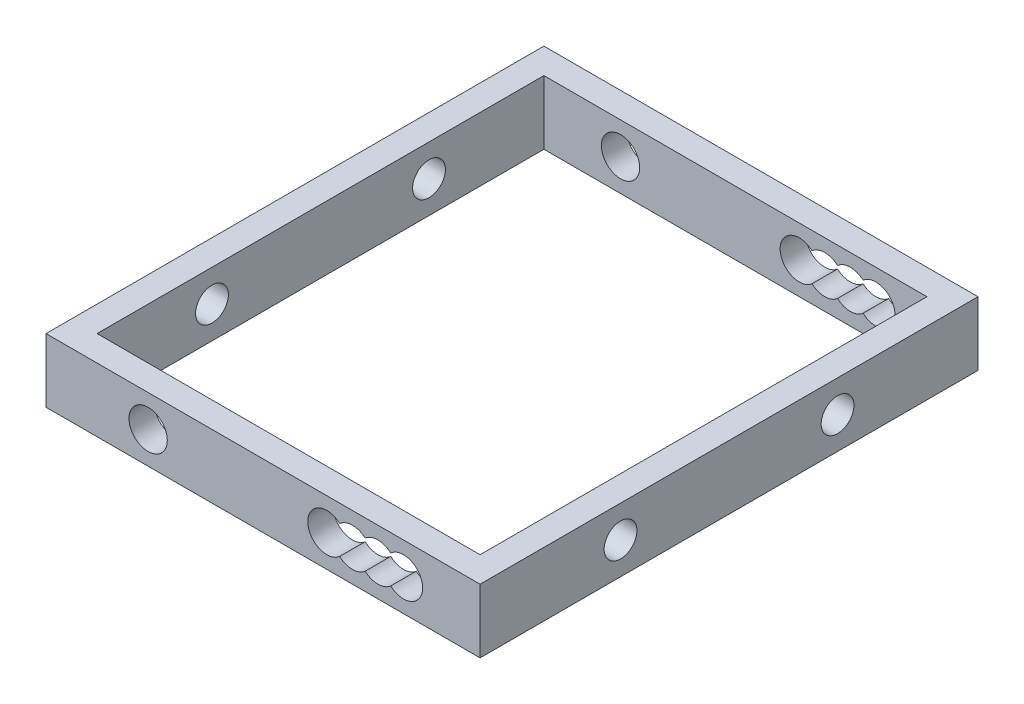
ISO-10303-21;
HEADER;
FILE_DESCRIPTION(('STEP AP214'),'2;1');
FILE_NAME('part.step','',(''),(''),'','','');
FILE_SCHEMA(('AUTOMOTIVE_DESIGN { 1 0 10303 214 1 1 1 1 }'));
ENDSEC;
DATA;
#1=APPLICATION_CONTEXT('core data for automotive mechanical design processes');
#2=APPLICATION_PROTOCOL_DEFINITION('international standard','automotive_design',2000,#1);
#3=PRODUCT_CONTEXT('',#1,'mechanical');
#4=PRODUCT('Part','Part','',(#3));
#5=PRODUCT_RELATED_PRODUCT_CATEGORY('part','',(#4));
#6=PRODUCT_DEFINITION_FORMATION('','',#4);
#7=PRODUCT_DEFINITION_CONTEXT('part definition',#1,'design');
#8=PRODUCT_DEFINITION('design','',#6,#7);
#9=PRODUCT_DEFINITION_SHAPE('','',#8);
#10=(LENGTH_UNIT() NAMED_UNIT(*) SI_UNIT(.MILLI.,.METRE.));
#11=(NAMED_UNIT(*) PLANE_ANGLE_UNIT() SI_UNIT($,.RADIAN.));
#12=(NAMED_UNIT(*) SI_UNIT($,.STERADIAN.) SOLID_ANGLE_UNIT());
#13=UNCERTAINTY_MEASURE_WITH_UNIT(LENGTH_MEASURE(1.E-05),#10,'distance_accuracy_value','');
#14=(GEOMETRIC_REPRESENTATION_CONTEXT(3) GLOBAL_UNCERTAINTY_ASSIGNED_CONTEXT((#13)) GLOBAL_UNIT_ASSIGNED_CONTEXT((#10,
#11,#12)) REPRESENTATION_CONTEXT('',''));
#15=CARTESIAN_POINT('',(0.,0.,0.));
#16=DIRECTION('',(0.,0.,1.));
#17=DIRECTION('',(1.,0.,0.));
#18=AXIS2_PLACEMENT_3D('',#15,#16,#17);
#19=CARTESIAN_POINT('',(15.,-2.5,-37.));
#20=DIRECTION('',(-1.,0.,0.));
#21=DIRECTION('',(0.,0.,1.));
#22=AXIS2_PLACEMENT_3D('',#19,#20,#21);
#23=PLANE('',#22);
#24=CARTESIAN_POINT('',(15.,0.,-26.));
#25=DIRECTION('',(-1.,0.,0.));
#26=DIRECTION('',(0.,0.,1.));
#27=AXIS2_PLACEMENT_3D('',#24,#25,#26);
#28=CIRCLE('',#27,1.28530424586943);
#29=CARTESIAN_POINT('',(15.,0.,-24.7146957541306));
#30=VERTEX_POINT('',#29);
#31=EDGE_CURVE('E285',#30,#30,#28,.T.);
#32=ORIENTED_EDGE('',*,*,#31,.F.);
#33=EDGE_LOOP('',(#32));
#34=FACE_BOUND('',#33,.T.);
#35=CARTESIAN_POINT('',(15.,0.,-9.));
#36=DIRECTION('',(-1.,0.,0.));
#37=DIRECTION('',(0.,0.,1.));
#38=AXIS2_PLACEMENT_3D('',#35,#36,#37);
#39=CIRCLE('',#38,1.28530424586943);
#40=CARTESIAN_POINT('',(15.,0.,-7.71469575413056));
#41=VERTEX_POINT('',#40);
#42=EDGE_CURVE('E282',#41,#41,#39,.T.);
#43=ORIENTED_EDGE('',*,*,#42,.F.);
#44=EDGE_LOOP('',(#43));
#45=FACE_BOUND('',#44,.T.);
#46=DIRECTION('',(0.,0.,1.));
#47=VECTOR('',#46,1.);
#48=CARTESIAN_POINT('',(15.,2.5,-37.));
#49=LINE('',#48,#47);
#50=CARTESIAN_POINT('',(15.,2.5,-35.));
#51=VERTEX_POINT('',#50);
#52=CARTESIAN_POINT('',(15.,2.5,0.));
#53=VERTEX_POINT('',#52);
#54=EDGE_CURVE('E49',#51,#53,#49,.T.);
#55=ORIENTED_EDGE('',*,*,#54,.F.);
#56=DIRECTION('',(0.,1.,0.));
#57=VECTOR('',#56,1.);
#58=CARTESIAN_POINT('',(15.,-2.5,-35.));
#59=LINE('',#58,#57);
#60=CARTESIAN_POINT('',(15.,-2.5,-35.));
#61=VERTEX_POINT('',#60);
#62=EDGE_CURVE('E54',#61,#51,#59,.T.);
#63=ORIENTED_EDGE('',*,*,#62,.F.);
#64=DIRECTION('',(0.,0.,1.));
#65=VECTOR('',#64,1.);
#66=CARTESIAN_POINT('',(15.,-2.5,-37.));
#67=LINE('',#66,#65);
#68=CARTESIAN_POINT('',(15.,-2.5,0.));
#69=VERTEX_POINT('',#68);
#70=EDGE_CURVE('E178',#61,#69,#67,.T.);
#71=ORIENTED_EDGE('',*,*,#70,.T.);
#72=DIRECTION('',(0.,1.,0.));
#73=VECTOR('',#72,1.);
#74=CARTESIAN_POINT('',(15.,-2.5,0.));
#75=LINE('',#74,#73);
#76=EDGE_CURVE('E319',#69,#53,#75,.T.);
#77=ORIENTED_EDGE('',*,*,#76,.T.);
#78=EDGE_LOOP('',(#55,#63,#71,#77));
#79=FACE_BOUND('',#78,.T.);
#80=ADVANCED_FACE('F32',(#34,#45,#79),#23,.T.);
#81=CARTESIAN_POINT('',(0.,0.,2.));
#82=DIRECTION('',(0.,0.,-1.));
#83=DIRECTION('',(-1.,0.,0.));
#84=AXIS2_PLACEMENT_3D('',#81,#82,#83);
#85=PLANE('',#84);
#86=CARTESIAN_POINT('',(-8.99999999999999,0.,2.));
#87=DIRECTION('',(0.,0.,1.));
#88=DIRECTION('',(1.,0.,0.));
#89=AXIS2_PLACEMENT_3D('',#86,#87,#88);
#90=CIRCLE('',#89,1.5);
#91=CARTESIAN_POINT('',(-7.49999999999999,0.,2.));
#92=VERTEX_POINT('',#91);
#93=EDGE_CURVE('E328',#92,#92,#90,.T.);
#94=ORIENTED_EDGE('',*,*,#93,.F.);
#95=EDGE_LOOP('',(#94));
#96=FACE_BOUND('',#95,.T.);
#97=DIRECTION('',(1.,0.,0.));
#98=VECTOR('',#97,1.);
#99=CARTESIAN_POINT('',(-15.,-2.5,2.));
#100=LINE('',#99,#98);
#101=CARTESIAN_POINT('',(-17.,-2.5,2.));
#102=VERTEX_POINT('',#101);
#103=CARTESIAN_POINT('',(17.,-2.5,2.));
#104=VERTEX_POINT('',#103);
#105=EDGE_CURVE('E11',#102,#104,#100,.T.);
#106=ORIENTED_EDGE('',*,*,#105,.T.);
#107=DIRECTION('',(0.,1.,0.));
#108=VECTOR('',#107,1.);
#109=CARTESIAN_POINT('',(17.,-2.5,2.));
#110=LINE('',#109,#108);
#111=CARTESIAN_POINT('',(17.,2.5,2.));
#112=VERTEX_POINT('',#111);
#113=EDGE_CURVE('E262',#104,#112,#110,.T.);
#114=ORIENTED_EDGE('',*,*,#113,.T.);
#115=DIRECTION('',(-1.,0.,0.));
#116=VECTOR('',#115,1.);
#117=CARTESIAN_POINT('',(-15.,2.5,2.));
#118=LINE('',#117,#116);
#119=CARTESIAN_POINT('',(-17.,2.5,2.));
#120=VERTEX_POINT('',#119);
#121=EDGE_CURVE('E41',#112,#120,#118,.T.);
#122=ORIENTED_EDGE('',*,*,#121,.T.);
#123=DIRECTION('',(0.,1.,0.));
#124=VECTOR('',#123,1.);
#125=CARTESIAN_POINT('',(-17.,-2.5,2.));
#126=LINE('',#125,#124);
#127=EDGE_CURVE('E191',#102,#120,#126,.T.);
#128=ORIENTED_EDGE('',*,*,#127,.F.);
#129=EDGE_LOOP('',(#106,#114,#122,#128));
#130=FACE_BOUND('',#129,.T.);
#131=CARTESIAN_POINT('',(7.00000000000001,0.,2.));
#132=DIRECTION('',(0.,0.,1.));
#133=DIRECTION('',(1.,0.,0.));
#134=AXIS2_PLACEMENT_3D('',#131,#132,#133);
#135=CIRCLE('',#134,1.5);
#136=CARTESIAN_POINT('',(6.00000000000001,-1.1180339887499,2.));
#137=VERTEX_POINT('',#136);
#138=CARTESIAN_POINT('',(8.00000000000001,-1.1180339887499,2.));
#139=VERTEX_POINT('',#138);
#140=EDGE_CURVE('E354',#137,#139,#135,.T.);
#141=ORIENTED_EDGE('',*,*,#140,.F.);
#142=CARTESIAN_POINT('',(5.00000000000001,0.,2.));
#143=DIRECTION('',(0.,0.,1.));
#144=DIRECTION('',(1.,0.,0.));
#145=AXIS2_PLACEMENT_3D('',#142,#143,#144);
#146=CIRCLE('',#145,1.5);
#147=CARTESIAN_POINT('',(6.00000000000001,1.1180339887499,2.));
#148=VERTEX_POINT('',#147);
#149=EDGE_CURVE('E350',#148,#137,#146,.T.);
#150=ORIENTED_EDGE('',*,*,#149,.F.);
#151=CARTESIAN_POINT('',(7.00000000000001,0.,2.));
#152=DIRECTION('',(0.,0.,1.));
#153=DIRECTION('',(1.,0.,0.));
#154=AXIS2_PLACEMENT_3D('',#151,#152,#153);
#155=CIRCLE('',#154,1.5);
#156=CARTESIAN_POINT('',(8.00000000000001,1.1180339887499,2.));
#157=VERTEX_POINT('',#156);
#158=EDGE_CURVE('E370',#157,#148,#155,.T.);
#159=ORIENTED_EDGE('',*,*,#158,.F.);
#160=CARTESIAN_POINT('',(9.00000000000001,0.,2.));
#161=DIRECTION('',(0.,0.,1.));
#162=DIRECTION('',(1.,0.,0.));
#163=AXIS2_PLACEMENT_3D('',#160,#161,#162);
#164=CIRCLE('',#163,1.5);
#165=CARTESIAN_POINT('',(10.,1.1180339887499,2.));
#166=VERTEX_POINT('',#165);
#167=EDGE_CURVE('E373',#166,#157,#164,.T.);
#168=ORIENTED_EDGE('',*,*,#167,.F.);
#169=CARTESIAN_POINT('',(11.,0.,2.));
#170=DIRECTION('',(0.,0.,1.));
#171=DIRECTION('',(1.,0.,0.));
#172=AXIS2_PLACEMENT_3D('',#169,#170,#171);
#173=CIRCLE('',#172,1.5);
#174=CARTESIAN_POINT('',(10.,-1.1180339887499,2.));
#175=VERTEX_POINT('',#174);
#176=EDGE_CURVE('E375',#175,#166,#173,.T.);
#177=ORIENTED_EDGE('',*,*,#176,.F.);
#178=CARTESIAN_POINT('',(9.00000000000001,0.,2.));
#179=DIRECTION('',(0.,0.,1.));
#180=DIRECTION('',(1.,0.,0.));
#181=AXIS2_PLACEMENT_3D('',#178,#179,#180);
#182=CIRCLE('',#181,1.5);
#183=EDGE_CURVE('E377',#139,#175,#182,.T.);
#184=ORIENTED_EDGE('',*,*,#183,.F.);
#185=EDGE_LOOP('',(#141,#150,#159,#168,#177,#184));
#186=FACE_BOUND('',#185,.T.);
#187=ADVANCED_FACE('F393',(#96,#130,#186),#85,.F.);
#188=CARTESIAN_POINT('',(0.,0.,0.));
#189=DIRECTION('',(0.,0.,-1.));
#190=DIRECTION('',(-1.,0.,0.));
#191=AXIS2_PLACEMENT_3D('',#188,#189,#190);
#192=PLANE('',#191);
#193=CARTESIAN_POINT('',(-8.99999999999999,0.,0.));
#194=DIRECTION('',(0.,0.,1.));
#195=DIRECTION('',(1.,0.,0.));
#196=AXIS2_PLACEMENT_3D('',#193,#194,#195);
#197=CIRCLE('',#196,1.5);
#198=CARTESIAN_POINT('',(-7.49999999999999,0.,0.));
#199=VERTEX_POINT('',#198);
#200=EDGE_CURVE('E331',#199,#199,#197,.T.);
#201=ORIENTED_EDGE('',*,*,#200,.T.);
#202=EDGE_LOOP('',(#201));
#203=FACE_BOUND('',#202,.T.);
#204=ORIENTED_EDGE('',*,*,#76,.F.);
#205=DIRECTION('',(1.,0.,0.));
#206=VECTOR('',#205,1.);
#207=CARTESIAN_POINT('',(-15.,-2.5,0.));
#208=LINE('',#207,#206);
#209=CARTESIAN_POINT('',(-15.,-2.5,0.));
#210=VERTEX_POINT('',#209);
#211=EDGE_CURVE('E304',#210,#69,#208,.T.);
#212=ORIENTED_EDGE('',*,*,#211,.F.);
#213=DIRECTION('',(0.,-1.,0.));
#214=VECTOR('',#213,1.);
#215=CARTESIAN_POINT('',(-15.,-2.5,0.));
#216=LINE('',#215,#214);
#217=CARTESIAN_POINT('',(-15.,2.5,0.));
#218=VERTEX_POINT('',#217);
#219=EDGE_CURVE('E309',#218,#210,#216,.T.);
#220=ORIENTED_EDGE('',*,*,#219,.F.);
#221=DIRECTION('',(-1.,0.,0.));
#222=VECTOR('',#221,1.);
#223=CARTESIAN_POINT('',(-15.,2.5,0.));
#224=LINE('',#223,#222);
#225=EDGE_CURVE('E315',#53,#218,#224,.T.);
#226=ORIENTED_EDGE('',*,*,#225,.F.);
#227=EDGE_LOOP('',(#204,#212,#220,#226));
#228=FACE_BOUND('',#227,.T.);
#229=CARTESIAN_POINT('',(5.00000000000001,0.,0.));
#230=DIRECTION('',(0.,0.,1.));
#231=DIRECTION('',(1.,0.,0.));
#232=AXIS2_PLACEMENT_3D('',#229,#230,#231);
#233=CIRCLE('',#232,1.5);
#234=CARTESIAN_POINT('',(6.00000000000001,1.1180339887499,0.));
#235=VERTEX_POINT('',#234);
#236=CARTESIAN_POINT('',(6.00000000000001,-1.1180339887499,0.));
#237=VERTEX_POINT('',#236);
#238=EDGE_CURVE('E351',#235,#237,#233,.T.);
#239=ORIENTED_EDGE('',*,*,#238,.T.);
#240=CARTESIAN_POINT('',(7.00000000000001,0.,0.));
#241=DIRECTION('',(0.,0.,1.));
#242=DIRECTION('',(1.,0.,0.));
#243=AXIS2_PLACEMENT_3D('',#240,#241,#242);
#244=CIRCLE('',#243,1.5);
#245=CARTESIAN_POINT('',(8.00000000000001,-1.1180339887499,0.));
#246=VERTEX_POINT('',#245);
#247=EDGE_CURVE('E272',#237,#246,#244,.T.);
#248=ORIENTED_EDGE('',*,*,#247,.T.);
#249=CARTESIAN_POINT('',(9.00000000000001,0.,0.));
#250=DIRECTION('',(0.,0.,1.));
#251=DIRECTION('',(1.,0.,0.));
#252=AXIS2_PLACEMENT_3D('',#249,#250,#251);
#253=CIRCLE('',#252,1.5);
#254=CARTESIAN_POINT('',(10.,-1.1180339887499,0.));
#255=VERTEX_POINT('',#254);
#256=EDGE_CURVE('E364',#246,#255,#253,.T.);
#257=ORIENTED_EDGE('',*,*,#256,.T.);
#258=CARTESIAN_POINT('',(11.,0.,0.));
#259=DIRECTION('',(0.,0.,1.));
#260=DIRECTION('',(1.,0.,0.));
#261=AXIS2_PLACEMENT_3D('',#258,#259,#260);
#262=CIRCLE('',#261,1.5);
#263=CARTESIAN_POINT('',(10.,1.1180339887499,0.));
#264=VERTEX_POINT('',#263);
#265=EDGE_CURVE('E361',#255,#264,#262,.T.);
#266=ORIENTED_EDGE('',*,*,#265,.T.);
#267=CARTESIAN_POINT('',(9.00000000000001,0.,0.));
#268=DIRECTION('',(0.,0.,1.));
#269=DIRECTION('',(1.,0.,0.));
#270=AXIS2_PLACEMENT_3D('',#267,#268,#269);
#271=CIRCLE('',#270,1.5);
#272=CARTESIAN_POINT('',(8.00000000000001,1.1180339887499,0.));
#273=VERTEX_POINT('',#272);
#274=EDGE_CURVE('E358',#264,#273,#271,.T.);
#275=ORIENTED_EDGE('',*,*,#274,.T.);
#276=CARTESIAN_POINT('',(7.00000000000001,0.,0.));
#277=DIRECTION('',(0.,0.,1.));
#278=DIRECTION('',(1.,0.,0.));
#279=AXIS2_PLACEMENT_3D('',#276,#277,#278);
#280=CIRCLE('',#279,1.5);
#281=EDGE_CURVE('E355',#273,#235,#280,.T.);
#282=ORIENTED_EDGE('',*,*,#281,.T.);
#283=EDGE_LOOP('',(#239,#248,#257,#266,#275,#282));
#284=FACE_BOUND('',#283,.T.);
#285=ADVANCED_FACE('F317',(#203,#228,#284),#192,.T.);
#286=CARTESIAN_POINT('',(-15.,2.5,2.));
#287=DIRECTION('',(0.,-1.,0.));
#288=DIRECTION('',(0.,0.,-1.));
#289=AXIS2_PLACEMENT_3D('',#286,#287,#288);
#290=PLANE('',#289);
#291=ORIENTED_EDGE('',*,*,#225,.T.);
#292=DIRECTION('',(0.,0.,1.));
#293=VECTOR('',#292,1.);
#294=CARTESIAN_POINT('',(-15.,2.5,-37.));
#295=LINE('',#294,#293);
#296=CARTESIAN_POINT('',(-15.,2.5,-35.));
#297=VERTEX_POINT('',#296);
#298=EDGE_CURVE('E190',#297,#218,#295,.T.);
#299=ORIENTED_EDGE('',*,*,#298,.F.);
#300=DIRECTION('',(-1.,0.,0.));
#301=VECTOR('',#300,1.);
#302=CARTESIAN_POINT('',(-15.,2.5,-35.));
#303=LINE('',#302,#301);
#304=EDGE_CURVE('E255',#51,#297,#303,.T.);
#305=ORIENTED_EDGE('',*,*,#304,.F.);
#306=ORIENTED_EDGE('',*,*,#54,.T.);
#307=EDGE_LOOP('',(#291,#299,#305,#306));
#308=FACE_BOUND('',#307,.T.);
#309=DIRECTION('',(0.,0.,1.));
#310=VECTOR('',#309,1.);
#311=CARTESIAN_POINT('',(-17.,2.5,-37.));
#312=LINE('',#311,#310);
#313=CARTESIAN_POINT('',(-17.,2.5,-37.));
#314=VERTEX_POINT('',#313);
#315=EDGE_CURVE('E172',#314,#120,#312,.T.);
#316=ORIENTED_EDGE('',*,*,#315,.T.);
#317=ORIENTED_EDGE('',*,*,#121,.F.);
#318=DIRECTION('',(0.,0.,1.));
#319=VECTOR('',#318,1.);
#320=CARTESIAN_POINT('',(17.,2.5,-37.));
#321=LINE('',#320,#319);
#322=CARTESIAN_POINT('',(17.,2.5,-37.));
#323=VERTEX_POINT('',#322);
#324=EDGE_CURVE('E174',#323,#112,#321,.T.);
#325=ORIENTED_EDGE('',*,*,#324,.F.);
#326=DIRECTION('',(-1.,0.,0.));
#327=VECTOR('',#326,1.);
#328=CARTESIAN_POINT('',(15.,2.5,-37.));
#329=LINE('',#328,#327);
#330=EDGE_CURVE('E169',#323,#314,#329,.T.);
#331=ORIENTED_EDGE('',*,*,#330,.T.);
#332=EDGE_LOOP('',(#316,#317,#325,#331));
#333=FACE_BOUND('',#332,.T.);
#334=ADVANCED_FACE('F34',(#308,#333),#290,.F.);
#335=CARTESIAN_POINT('',(-15.,-2.5,2.));
#336=DIRECTION('',(0.,1.,0.));
#337=DIRECTION('',(0.,0.,1.));
#338=AXIS2_PLACEMENT_3D('',#335,#336,#337);
#339=PLANE('',#338);
#340=DIRECTION('',(0.,0.,1.));
#341=VECTOR('',#340,1.);
#342=CARTESIAN_POINT('',(-15.,-2.5,-37.));
#343=LINE('',#342,#341);
#344=CARTESIAN_POINT('',(-15.,-2.5,-35.));
#345=VERTEX_POINT('',#344);
#346=EDGE_CURVE('E198',#345,#210,#343,.T.);
#347=ORIENTED_EDGE('',*,*,#346,.T.);
#348=ORIENTED_EDGE('',*,*,#211,.T.);
#349=ORIENTED_EDGE('',*,*,#70,.F.);
#350=DIRECTION('',(1.,0.,0.));
#351=VECTOR('',#350,1.);
#352=CARTESIAN_POINT('',(-15.,-2.5,-35.));
#353=LINE('',#352,#351);
#354=EDGE_CURVE('E259',#345,#61,#353,.T.);
#355=ORIENTED_EDGE('',*,*,#354,.F.);
#356=EDGE_LOOP('',(#347,#348,#349,#355));
#357=FACE_BOUND('',#356,.T.);
#358=ORIENTED_EDGE('',*,*,#105,.F.);
#359=DIRECTION('',(0.,0.,1.));
#360=VECTOR('',#359,1.);
#361=CARTESIAN_POINT('',(-17.,-2.5,-37.));
#362=LINE('',#361,#360);
#363=CARTESIAN_POINT('',(-17.,-2.5,-37.));
#364=VERTEX_POINT('',#363);
#365=EDGE_CURVE('E196',#364,#102,#362,.T.);
#366=ORIENTED_EDGE('',*,*,#365,.F.);
#367=DIRECTION('',(1.,0.,0.));
#368=VECTOR('',#367,1.);
#369=CARTESIAN_POINT('',(15.,-2.5,-37.));
#370=LINE('',#369,#368);
#371=CARTESIAN_POINT('',(17.,-2.5,-37.));
#372=VERTEX_POINT('',#371);
#373=EDGE_CURVE('E186',#364,#372,#370,.T.);
#374=ORIENTED_EDGE('',*,*,#373,.T.);
#375=DIRECTION('',(0.,0.,1.));
#376=VECTOR('',#375,1.);
#377=CARTESIAN_POINT('',(17.,-2.5,-37.));
#378=LINE('',#377,#376);
#379=EDGE_CURVE('E380',#372,#104,#378,.T.);
#380=ORIENTED_EDGE('',*,*,#379,.T.);
#381=EDGE_LOOP('',(#358,#366,#374,#380));
#382=FACE_BOUND('',#381,.T.);
#383=ADVANCED_FACE('F301',(#357,#382),#339,.F.);
#384=CARTESIAN_POINT('',(-8.99999999999999,0.,2.));
#385=DIRECTION('',(0.,0.,-1.));
#386=DIRECTION('',(-1.,0.,0.));
#387=AXIS2_PLACEMENT_3D('',#384,#385,#386);
#388=CYLINDRICAL_SURFACE('',#387,1.5);
#389=ORIENTED_EDGE('',*,*,#93,.T.);
#390=EDGE_LOOP('',(#389));
#391=FACE_BOUND('',#390,.T.);
#392=ORIENTED_EDGE('',*,*,#200,.F.);
#393=EDGE_LOOP('',(#392));
#394=FACE_BOUND('',#393,.T.);
#395=ADVANCED_FACE('F392',(#391,#394),#388,.F.);
#396=CARTESIAN_POINT('',(7.00000000000001,0.,2.));
#397=DIRECTION('',(0.,0.,-1.));
#398=DIRECTION('',(-1.,0.,0.));
#399=AXIS2_PLACEMENT_3D('',#396,#397,#398);
#400=CYLINDRICAL_SURFACE('',#399,1.5);
#401=ORIENTED_EDGE('',*,*,#247,.F.);
#402=DIRECTION('',(0.,0.,-1.));
#403=VECTOR('',#402,1.);
#404=CARTESIAN_POINT('',(6.00000000000001,-1.1180339887499,2.));
#405=LINE('',#404,#403);
#406=EDGE_CURVE('E347',#137,#237,#405,.T.);
#407=ORIENTED_EDGE('',*,*,#406,.F.);
#408=ORIENTED_EDGE('',*,*,#140,.T.);
#409=DIRECTION('',(0.,0.,-1.));
#410=VECTOR('',#409,1.);
#411=CARTESIAN_POINT('',(8.00000000000001,-1.1180339887499,2.));
#412=LINE('',#411,#410);
#413=EDGE_CURVE('E334',#139,#246,#412,.T.);
#414=ORIENTED_EDGE('',*,*,#413,.T.);
#415=EDGE_LOOP('',(#401,#407,#408,#414));
#416=FACE_BOUND('',#415,.T.);
#417=ADVANCED_FACE('F429',(#416),#400,.F.);
#418=CARTESIAN_POINT('',(9.00000000000001,0.,2.));
#419=DIRECTION('',(0.,0.,-1.));
#420=DIRECTION('',(-1.,0.,0.));
#421=AXIS2_PLACEMENT_3D('',#418,#419,#420);
#422=CYLINDRICAL_SURFACE('',#421,1.5);
#423=ORIENTED_EDGE('',*,*,#256,.F.);
#424=ORIENTED_EDGE('',*,*,#413,.F.);
#425=ORIENTED_EDGE('',*,*,#183,.T.);
#426=DIRECTION('',(0.,0.,-1.));
#427=VECTOR('',#426,1.);
#428=CARTESIAN_POINT('',(10.,-1.1180339887499,2.));
#429=LINE('',#428,#427);
#430=EDGE_CURVE('E339',#175,#255,#429,.T.);
#431=ORIENTED_EDGE('',*,*,#430,.T.);
#432=EDGE_LOOP('',(#423,#424,#425,#431));
#433=FACE_BOUND('',#432,.T.);
#434=ADVANCED_FACE('F425',(#433),#422,.F.);
#435=CARTESIAN_POINT('',(11.,0.,2.));
#436=DIRECTION('',(0.,0.,-1.));
#437=DIRECTION('',(-1.,0.,0.));
#438=AXIS2_PLACEMENT_3D('',#435,#436,#437);
#439=CYLINDRICAL_SURFACE('',#438,1.5);
#440=ORIENTED_EDGE('',*,*,#265,.F.);
#441=ORIENTED_EDGE('',*,*,#430,.F.);
#442=ORIENTED_EDGE('',*,*,#176,.T.);
#443=DIRECTION('',(0.,0.,-1.));
#444=VECTOR('',#443,1.);
#445=CARTESIAN_POINT('',(10.,1.1180339887499,2.));
#446=LINE('',#445,#444);
#447=EDGE_CURVE('E341',#166,#264,#446,.T.);
#448=ORIENTED_EDGE('',*,*,#447,.T.);
#449=EDGE_LOOP('',(#440,#441,#442,#448));
#450=FACE_BOUND('',#449,.T.);
#451=ADVANCED_FACE('F421',(#450),#439,.F.);
#452=CARTESIAN_POINT('',(9.00000000000001,0.,2.));
#453=DIRECTION('',(0.,0.,-1.));
#454=DIRECTION('',(-1.,0.,0.));
#455=AXIS2_PLACEMENT_3D('',#452,#453,#454);
#456=CYLINDRICAL_SURFACE('',#455,1.5);
#457=ORIENTED_EDGE('',*,*,#274,.F.);
#458=ORIENTED_EDGE('',*,*,#447,.F.);
#459=ORIENTED_EDGE('',*,*,#167,.T.);
#460=DIRECTION('',(0.,0.,-1.));
#461=VECTOR('',#460,1.);
#462=CARTESIAN_POINT('',(8.00000000000001,1.1180339887499,2.));
#463=LINE('',#462,#461);
#464=EDGE_CURVE('E343',#157,#273,#463,.T.);
#465=ORIENTED_EDGE('',*,*,#464,.T.);
#466=EDGE_LOOP('',(#457,#458,#459,#465));
#467=FACE_BOUND('',#466,.T.);
#468=ADVANCED_FACE('F417',(#467),#456,.F.);
#469=CARTESIAN_POINT('',(7.00000000000001,0.,2.));
#470=DIRECTION('',(0.,0.,-1.));
#471=DIRECTION('',(-1.,0.,0.));
#472=AXIS2_PLACEMENT_3D('',#469,#470,#471);
#473=CYLINDRICAL_SURFACE('',#472,1.5);
#474=ORIENTED_EDGE('',*,*,#281,.F.);
#475=ORIENTED_EDGE('',*,*,#464,.F.);
#476=ORIENTED_EDGE('',*,*,#158,.T.);
#477=DIRECTION('',(0.,0.,-1.));
#478=VECTOR('',#477,1.);
#479=CARTESIAN_POINT('',(6.00000000000001,1.1180339887499,2.));
#480=LINE('',#479,#478);
#481=EDGE_CURVE('E345',#148,#235,#480,.T.);
#482=ORIENTED_EDGE('',*,*,#481,.T.);
#483=EDGE_LOOP('',(#474,#475,#476,#482));
#484=FACE_BOUND('',#483,.T.);
#485=ADVANCED_FACE('F413',(#484),#473,.F.);
#486=CARTESIAN_POINT('',(5.00000000000001,0.,2.));
#487=DIRECTION('',(0.,0.,-1.));
#488=DIRECTION('',(-1.,0.,0.));
#489=AXIS2_PLACEMENT_3D('',#486,#487,#488);
#490=CYLINDRICAL_SURFACE('',#489,1.5);
#491=ORIENTED_EDGE('',*,*,#238,.F.);
#492=ORIENTED_EDGE('',*,*,#481,.F.);
#493=ORIENTED_EDGE('',*,*,#149,.T.);
#494=ORIENTED_EDGE('',*,*,#406,.T.);
#495=EDGE_LOOP('',(#491,#492,#493,#494));
#496=FACE_BOUND('',#495,.T.);
#497=ADVANCED_FACE('F410',(#496),#490,.F.);
#498=CARTESIAN_POINT('',(17.,-2.5,-37.));
#499=DIRECTION('',(1.,0.,0.));
#500=DIRECTION('',(0.,0.,-1.));
#501=AXIS2_PLACEMENT_3D('',#498,#499,#500);
#502=PLANE('',#501);
#503=CARTESIAN_POINT('',(17.,0.,-26.));
#504=DIRECTION('',(1.,0.,0.));
#505=DIRECTION('',(0.,0.,-1.));
#506=AXIS2_PLACEMENT_3D('',#503,#504,#505);
#507=CIRCLE('',#506,1.28530424586943);
#508=CARTESIAN_POINT('',(17.,0.,-27.2853042458694));
#509=VERTEX_POINT('',#508);
#510=EDGE_CURVE('E467',#509,#509,#507,.T.);
#511=ORIENTED_EDGE('',*,*,#510,.F.);
#512=EDGE_LOOP('',(#511));
#513=FACE_BOUND('',#512,.T.);
#514=CARTESIAN_POINT('',(17.,0.,-9.));
#515=DIRECTION('',(1.,0.,0.));
#516=DIRECTION('',(0.,0.,-1.));
#517=AXIS2_PLACEMENT_3D('',#514,#515,#516);
#518=CIRCLE('',#517,1.28530424586943);
#519=CARTESIAN_POINT('',(17.,0.,-10.2853042458694));
#520=VERTEX_POINT('',#519);
#521=EDGE_CURVE('E278',#520,#520,#518,.T.);
#522=ORIENTED_EDGE('',*,*,#521,.F.);
#523=EDGE_LOOP('',(#522));
#524=FACE_BOUND('',#523,.T.);
#525=ORIENTED_EDGE('',*,*,#113,.F.);
#526=ORIENTED_EDGE('',*,*,#379,.F.);
#527=DIRECTION('',(0.,1.,0.));
#528=VECTOR('',#527,1.);
#529=CARTESIAN_POINT('',(17.,-2.5,-37.));
#530=LINE('',#529,#528);
#531=EDGE_CURVE('E179',#372,#323,#530,.T.);
#532=ORIENTED_EDGE('',*,*,#531,.T.);
#533=ORIENTED_EDGE('',*,*,#324,.T.);
#534=EDGE_LOOP('',(#525,#526,#532,#533));
#535=FACE_BOUND('',#534,.T.);
#536=ADVANCED_FACE('F408',(#513,#524,#535),#502,.T.);
#537=CARTESIAN_POINT('',(0.,0.,-37.));
#538=DIRECTION('',(0.,0.,-1.));
#539=DIRECTION('',(-1.,0.,0.));
#540=AXIS2_PLACEMENT_3D('',#537,#538,#539);
#541=PLANE('',#540);
#542=ORIENTED_EDGE('',*,*,#373,.F.);
#543=DIRECTION('',(0.,1.,0.));
#544=VECTOR('',#543,1.);
#545=CARTESIAN_POINT('',(-17.,-2.5,-37.));
#546=LINE('',#545,#544);
#547=EDGE_CURVE('E182',#364,#314,#546,.T.);
#548=ORIENTED_EDGE('',*,*,#547,.T.);
#549=ORIENTED_EDGE('',*,*,#330,.F.);
#550=ORIENTED_EDGE('',*,*,#531,.F.);
#551=EDGE_LOOP('',(#542,#548,#549,#550));
#552=FACE_BOUND('',#551,.T.);
#553=CARTESIAN_POINT('',(-8.99999999999999,0.,-37.));
#554=DIRECTION('',(0.,0.,1.));
#555=DIRECTION('',(1.,0.,0.));
#556=AXIS2_PLACEMENT_3D('',#553,#554,#555);
#557=CIRCLE('',#556,1.5);
#558=CARTESIAN_POINT('',(-7.49999999999999,0.,-37.));
#559=VERTEX_POINT('',#558);
#560=EDGE_CURVE('E248',#559,#559,#557,.T.);
#561=ORIENTED_EDGE('',*,*,#560,.T.);
#562=EDGE_LOOP('',(#561));
#563=FACE_BOUND('',#562,.T.);
#564=CARTESIAN_POINT('',(5.00000000000001,0.,-37.));
#565=DIRECTION('',(0.,0.,1.));
#566=DIRECTION('',(1.,0.,0.));
#567=AXIS2_PLACEMENT_3D('',#564,#565,#566);
#568=CIRCLE('',#567,1.5);
#569=CARTESIAN_POINT('',(6.00000000000001,1.1180339887499,-37.));
#570=VERTEX_POINT('',#569);
#571=CARTESIAN_POINT('',(6.00000000000001,-1.1180339887499,-37.));
#572=VERTEX_POINT('',#571);
#573=EDGE_CURVE('E206',#570,#572,#568,.T.);
#574=ORIENTED_EDGE('',*,*,#573,.T.);
#575=CARTESIAN_POINT('',(7.00000000000001,0.,-37.));
#576=DIRECTION('',(0.,0.,1.));
#577=DIRECTION('',(1.,0.,0.));
#578=AXIS2_PLACEMENT_3D('',#575,#576,#577);
#579=CIRCLE('',#578,1.5);
#580=CARTESIAN_POINT('',(8.00000000000001,-1.1180339887499,-37.));
#581=VERTEX_POINT('',#580);
#582=EDGE_CURVE('E218',#572,#581,#579,.T.);
#583=ORIENTED_EDGE('',*,*,#582,.T.);
#584=CARTESIAN_POINT('',(9.00000000000001,0.,-37.));
#585=DIRECTION('',(0.,0.,1.));
#586=DIRECTION('',(1.,0.,0.));
#587=AXIS2_PLACEMENT_3D('',#584,#585,#586);
#588=CIRCLE('',#587,1.5);
#589=CARTESIAN_POINT('',(10.,-1.1180339887499,-37.));
#590=VERTEX_POINT('',#589);
#591=EDGE_CURVE('E221',#581,#590,#588,.T.);
#592=ORIENTED_EDGE('',*,*,#591,.T.);
#593=CARTESIAN_POINT('',(11.,0.,-37.));
#594=DIRECTION('',(0.,0.,1.));
#595=DIRECTION('',(1.,0.,0.));
#596=AXIS2_PLACEMENT_3D('',#593,#594,#595);
#597=CIRCLE('',#596,1.5);
#598=CARTESIAN_POINT('',(10.,1.1180339887499,-37.));
#599=VERTEX_POINT('',#598);
#600=EDGE_CURVE('E224',#590,#599,#597,.T.);
#601=ORIENTED_EDGE('',*,*,#600,.T.);
#602=CARTESIAN_POINT('',(9.00000000000001,0.,-37.));
#603=DIRECTION('',(0.,0.,1.));
#604=DIRECTION('',(1.,0.,0.));
#605=AXIS2_PLACEMENT_3D('',#602,#603,#604);
#606=CIRCLE('',#605,1.5);
#607=CARTESIAN_POINT('',(8.00000000000001,1.1180339887499,-37.));
#608=VERTEX_POINT('',#607);
#609=EDGE_CURVE('E227',#599,#608,#606,.T.);
#610=ORIENTED_EDGE('',*,*,#609,.T.);
#611=CARTESIAN_POINT('',(7.00000000000001,0.,-37.));
#612=DIRECTION('',(0.,0.,1.));
#613=DIRECTION('',(1.,0.,0.));
#614=AXIS2_PLACEMENT_3D('',#611,#612,#613);
#615=CIRCLE('',#614,1.5);
#616=EDGE_CURVE('E230',#608,#570,#615,.T.);
#617=ORIENTED_EDGE('',*,*,#616,.T.);
#618=EDGE_LOOP('',(#574,#583,#592,#601,#610,#617));
#619=FACE_BOUND('',#618,.T.);
#620=ADVANCED_FACE('F183',(#552,#563,#619),#541,.T.);
#621=CARTESIAN_POINT('',(0.,0.,-35.));
#622=DIRECTION('',(0.,0.,-1.));
#623=DIRECTION('',(-1.,0.,0.));
#624=AXIS2_PLACEMENT_3D('',#621,#622,#623);
#625=PLANE('',#624);
#626=CARTESIAN_POINT('',(-8.99999999999999,0.,-35.));
#627=DIRECTION('',(0.,0.,1.));
#628=DIRECTION('',(1.,0.,0.));
#629=AXIS2_PLACEMENT_3D('',#626,#627,#628);
#630=CIRCLE('',#629,1.5);
#631=CARTESIAN_POINT('',(-7.49999999999999,0.,-35.));
#632=VERTEX_POINT('',#631);
#633=EDGE_CURVE('E249',#632,#632,#630,.T.);
#634=ORIENTED_EDGE('',*,*,#633,.F.);
#635=EDGE_LOOP('',(#634));
#636=FACE_BOUND('',#635,.T.);
#637=ORIENTED_EDGE('',*,*,#62,.T.);
#638=ORIENTED_EDGE('',*,*,#304,.T.);
#639=DIRECTION('',(0.,-1.,0.));
#640=VECTOR('',#639,1.);
#641=CARTESIAN_POINT('',(-15.,-2.5,-35.));
#642=LINE('',#641,#640);
#643=EDGE_CURVE('E257',#297,#345,#642,.T.);
#644=ORIENTED_EDGE('',*,*,#643,.T.);
#645=ORIENTED_EDGE('',*,*,#354,.T.);
#646=EDGE_LOOP('',(#637,#638,#644,#645));
#647=FACE_BOUND('',#646,.T.);
#648=CARTESIAN_POINT('',(7.00000000000001,0.,-35.));
#649=DIRECTION('',(0.,0.,1.));
#650=DIRECTION('',(1.,0.,0.));
#651=AXIS2_PLACEMENT_3D('',#648,#649,#650);
#652=CIRCLE('',#651,1.5);
#653=CARTESIAN_POINT('',(6.00000000000001,-1.1180339887499,-35.));
#654=VERTEX_POINT('',#653);
#655=CARTESIAN_POINT('',(8.00000000000001,-1.1180339887499,-35.));
#656=VERTEX_POINT('',#655);
#657=EDGE_CURVE('E203',#654,#656,#652,.T.);
#658=ORIENTED_EDGE('',*,*,#657,.F.);
#659=CARTESIAN_POINT('',(5.00000000000001,0.,-35.));
#660=DIRECTION('',(0.,0.,1.));
#661=DIRECTION('',(1.,0.,0.));
#662=AXIS2_PLACEMENT_3D('',#659,#660,#661);
#663=CIRCLE('',#662,1.5);
#664=CARTESIAN_POINT('',(6.00000000000001,1.1180339887499,-35.));
#665=VERTEX_POINT('',#664);
#666=EDGE_CURVE('E215',#665,#654,#663,.T.);
#667=ORIENTED_EDGE('',*,*,#666,.F.);
#668=CARTESIAN_POINT('',(7.00000000000001,0.,-35.));
#669=DIRECTION('',(0.,0.,1.));
#670=DIRECTION('',(1.,0.,0.));
#671=AXIS2_PLACEMENT_3D('',#668,#669,#670);
#672=CIRCLE('',#671,1.5);
#673=CARTESIAN_POINT('',(8.00000000000001,1.1180339887499,-35.));
#674=VERTEX_POINT('',#673);
#675=EDGE_CURVE('E212',#674,#665,#672,.T.);
#676=ORIENTED_EDGE('',*,*,#675,.F.);
#677=CARTESIAN_POINT('',(9.00000000000001,0.,-35.));
#678=DIRECTION('',(0.,0.,1.));
#679=DIRECTION('',(1.,0.,0.));
#680=AXIS2_PLACEMENT_3D('',#677,#678,#679);
#681=CIRCLE('',#680,1.5);
#682=CARTESIAN_POINT('',(10.,1.1180339887499,-35.));
#683=VERTEX_POINT('',#682);
#684=EDGE_CURVE('E210',#683,#674,#681,.T.);
#685=ORIENTED_EDGE('',*,*,#684,.F.);
#686=CARTESIAN_POINT('',(11.,0.,-35.));
#687=DIRECTION('',(0.,0.,1.));
#688=DIRECTION('',(1.,0.,0.));
#689=AXIS2_PLACEMENT_3D('',#686,#687,#688);
#690=CIRCLE('',#689,1.5);
#691=CARTESIAN_POINT('',(10.,-1.1180339887499,-35.));
#692=VERTEX_POINT('',#691);
#693=EDGE_CURVE('E208',#692,#683,#690,.T.);
#694=ORIENTED_EDGE('',*,*,#693,.F.);
#695=CARTESIAN_POINT('',(9.00000000000001,0.,-35.));
#696=DIRECTION('',(0.,0.,1.));
#697=DIRECTION('',(1.,0.,0.));
#698=AXIS2_PLACEMENT_3D('',#695,#696,#697);
#699=CIRCLE('',#698,1.5);
#700=EDGE_CURVE('E205',#656,#692,#699,.T.);
#701=ORIENTED_EDGE('',*,*,#700,.F.);
#702=EDGE_LOOP('',(#658,#667,#676,#685,#694,#701));
#703=FACE_BOUND('',#702,.T.);
#704=ADVANCED_FACE('F384',(#636,#647,#703),#625,.F.);
#705=CARTESIAN_POINT('',(-8.99999999999999,0.,-35.));
#706=DIRECTION('',(0.,0.,-1.));
#707=DIRECTION('',(-1.,0.,0.));
#708=AXIS2_PLACEMENT_3D('',#705,#706,#707);
#709=CYLINDRICAL_SURFACE('',#708,1.5);
#710=ORIENTED_EDGE('',*,*,#633,.T.);
#711=EDGE_LOOP('',(#710));
#712=FACE_BOUND('',#711,.T.);
#713=ORIENTED_EDGE('',*,*,#560,.F.);
#714=EDGE_LOOP('',(#713));
#715=FACE_BOUND('',#714,.T.);
#716=ADVANCED_FACE('F522',(#712,#715),#709,.F.);
#717=CARTESIAN_POINT('',(7.00000000000001,0.,-35.));
#718=DIRECTION('',(0.,0.,-1.));
#719=DIRECTION('',(-1.,0.,0.));
#720=AXIS2_PLACEMENT_3D('',#717,#718,#719);
#721=CYLINDRICAL_SURFACE('',#720,1.5);
#722=ORIENTED_EDGE('',*,*,#582,.F.);
#723=DIRECTION('',(0.,0.,-1.));
#724=VECTOR('',#723,1.);
#725=CARTESIAN_POINT('',(6.00000000000001,-1.1180339887499,-35.));
#726=LINE('',#725,#724);
#727=EDGE_CURVE('E217',#654,#572,#726,.T.);
#728=ORIENTED_EDGE('',*,*,#727,.F.);
#729=ORIENTED_EDGE('',*,*,#657,.T.);
#730=DIRECTION('',(0.,0.,-1.));
#731=VECTOR('',#730,1.);
#732=CARTESIAN_POINT('',(8.00000000000001,-1.1180339887499,-35.));
#733=LINE('',#732,#731);
#734=EDGE_CURVE('E245',#656,#581,#733,.T.);
#735=ORIENTED_EDGE('',*,*,#734,.T.);
#736=EDGE_LOOP('',(#722,#728,#729,#735));
#737=FACE_BOUND('',#736,.T.);
#738=ADVANCED_FACE('F518',(#737),#721,.F.);
#739=CARTESIAN_POINT('',(9.00000000000001,0.,-35.));
#740=DIRECTION('',(0.,0.,-1.));
#741=DIRECTION('',(-1.,0.,0.));
#742=AXIS2_PLACEMENT_3D('',#739,#740,#741);
#743=CYLINDRICAL_SURFACE('',#742,1.5);
#744=ORIENTED_EDGE('',*,*,#591,.F.);
#745=ORIENTED_EDGE('',*,*,#734,.F.);
#746=ORIENTED_EDGE('',*,*,#700,.T.);
#747=DIRECTION('',(0.,0.,-1.));
#748=VECTOR('',#747,1.);
#749=CARTESIAN_POINT('',(10.,-1.1180339887499,-35.));
#750=LINE('',#749,#748);
#751=EDGE_CURVE('E243',#692,#590,#750,.T.);
#752=ORIENTED_EDGE('',*,*,#751,.T.);
#753=EDGE_LOOP('',(#744,#745,#746,#752));
#754=FACE_BOUND('',#753,.T.);
#755=ADVANCED_FACE('F514',(#754),#743,.F.);
#756=CARTESIAN_POINT('',(11.,0.,-35.));
#757=DIRECTION('',(0.,0.,-1.));
#758=DIRECTION('',(-1.,0.,0.));
#759=AXIS2_PLACEMENT_3D('',#756,#757,#758);
#760=CYLINDRICAL_SURFACE('',#759,1.5);
#761=ORIENTED_EDGE('',*,*,#600,.F.);
#762=ORIENTED_EDGE('',*,*,#751,.F.);
#763=ORIENTED_EDGE('',*,*,#693,.T.);
#764=DIRECTION('',(0.,0.,-1.));
#765=VECTOR('',#764,1.);
#766=CARTESIAN_POINT('',(10.,1.1180339887499,-35.));
#767=LINE('',#766,#765);
#768=EDGE_CURVE('E241',#683,#599,#767,.T.);
#769=ORIENTED_EDGE('',*,*,#768,.T.);
#770=EDGE_LOOP('',(#761,#762,#763,#769));
#771=FACE_BOUND('',#770,.T.);
#772=ADVANCED_FACE('F510',(#771),#760,.F.);
#773=CARTESIAN_POINT('',(9.00000000000001,0.,-35.));
#774=DIRECTION('',(0.,0.,-1.));
#775=DIRECTION('',(-1.,0.,0.));
#776=AXIS2_PLACEMENT_3D('',#773,#774,#775);
#777=CYLINDRICAL_SURFACE('',#776,1.5);
#778=ORIENTED_EDGE('',*,*,#609,.F.);
#779=ORIENTED_EDGE('',*,*,#768,.F.);
#780=ORIENTED_EDGE('',*,*,#684,.T.);
#781=DIRECTION('',(0.,0.,-1.));
#782=VECTOR('',#781,1.);
#783=CARTESIAN_POINT('',(8.00000000000001,1.1180339887499,-35.));
#784=LINE('',#783,#782);
#785=EDGE_CURVE('E239',#674,#608,#784,.T.);
#786=ORIENTED_EDGE('',*,*,#785,.T.);
#787=EDGE_LOOP('',(#778,#779,#780,#786));
#788=FACE_BOUND('',#787,.T.);
#789=ADVANCED_FACE('F506',(#788),#777,.F.);
#790=CARTESIAN_POINT('',(7.00000000000001,0.,-35.));
#791=DIRECTION('',(0.,0.,-1.));
#792=DIRECTION('',(-1.,0.,0.));
#793=AXIS2_PLACEMENT_3D('',#790,#791,#792);
#794=CYLINDRICAL_SURFACE('',#793,1.5);
#795=ORIENTED_EDGE('',*,*,#616,.F.);
#796=ORIENTED_EDGE('',*,*,#785,.F.);
#797=ORIENTED_EDGE('',*,*,#675,.T.);
#798=DIRECTION('',(0.,0.,-1.));
#799=VECTOR('',#798,1.);
#800=CARTESIAN_POINT('',(6.00000000000001,1.1180339887499,-35.));
#801=LINE('',#800,#799);
#802=EDGE_CURVE('E237',#665,#570,#801,.T.);
#803=ORIENTED_EDGE('',*,*,#802,.T.);
#804=EDGE_LOOP('',(#795,#796,#797,#803));
#805=FACE_BOUND('',#804,.T.);
#806=ADVANCED_FACE('F502',(#805),#794,.F.);
#807=CARTESIAN_POINT('',(5.00000000000001,0.,-35.));
#808=DIRECTION('',(0.,0.,-1.));
#809=DIRECTION('',(-1.,0.,0.));
#810=AXIS2_PLACEMENT_3D('',#807,#808,#809);
#811=CYLINDRICAL_SURFACE('',#810,1.5);
#812=ORIENTED_EDGE('',*,*,#573,.F.);
#813=ORIENTED_EDGE('',*,*,#802,.F.);
#814=ORIENTED_EDGE('',*,*,#666,.T.);
#815=ORIENTED_EDGE('',*,*,#727,.T.);
#816=EDGE_LOOP('',(#812,#813,#814,#815));
#817=FACE_BOUND('',#816,.T.);
#818=ADVANCED_FACE('F499',(#817),#811,.F.);
#819=CARTESIAN_POINT('',(-15.,-2.5,-37.));
#820=DIRECTION('',(-1.,0.,0.));
#821=DIRECTION('',(0.,0.,1.));
#822=AXIS2_PLACEMENT_3D('',#819,#820,#821);
#823=PLANE('',#822);
#824=CARTESIAN_POINT('',(-15.,0.,-26.));
#825=DIRECTION('',(-1.,0.,0.));
#826=DIRECTION('',(0.,0.,1.));
#827=AXIS2_PLACEMENT_3D('',#824,#825,#826);
#828=CIRCLE('',#827,1.28530424586943);
#829=CARTESIAN_POINT('',(-15.,0.,-24.7146957541306));
#830=VERTEX_POINT('',#829);
#831=EDGE_CURVE('E290',#830,#830,#828,.T.);
#832=ORIENTED_EDGE('',*,*,#831,.T.);
#833=EDGE_LOOP('',(#832));
#834=FACE_BOUND('',#833,.T.);
#835=CARTESIAN_POINT('',(-15.,0.,-9.));
#836=DIRECTION('',(-1.,0.,0.));
#837=DIRECTION('',(0.,0.,1.));
#838=AXIS2_PLACEMENT_3D('',#835,#836,#837);
#839=CIRCLE('',#838,1.28530424586943);
#840=CARTESIAN_POINT('',(-15.,0.,-7.71469575413056));
#841=VERTEX_POINT('',#840);
#842=EDGE_CURVE('E277',#841,#841,#839,.T.);
#843=ORIENTED_EDGE('',*,*,#842,.T.);
#844=EDGE_LOOP('',(#843));
#845=FACE_BOUND('',#844,.T.);
#846=ORIENTED_EDGE('',*,*,#219,.T.);
#847=ORIENTED_EDGE('',*,*,#346,.F.);
#848=ORIENTED_EDGE('',*,*,#643,.F.);
#849=ORIENTED_EDGE('',*,*,#298,.T.);
#850=EDGE_LOOP('',(#846,#847,#848,#849));
#851=FACE_BOUND('',#850,.T.);
#852=ADVANCED_FACE('F310',(#834,#845,#851),#823,.F.);
#853=CARTESIAN_POINT('',(-17.,-2.5,-37.));
#854=DIRECTION('',(1.,0.,0.));
#855=DIRECTION('',(0.,0.,-1.));
#856=AXIS2_PLACEMENT_3D('',#853,#854,#855);
#857=PLANE('',#856);
#858=CARTESIAN_POINT('',(-17.,0.,-26.));
#859=DIRECTION('',(1.,0.,0.));
#860=DIRECTION('',(0.,0.,-1.));
#861=AXIS2_PLACEMENT_3D('',#858,#859,#860);
#862=CIRCLE('',#861,1.28530424586943);
#863=CARTESIAN_POINT('',(-17.,0.,-27.2853042458694));
#864=VERTEX_POINT('',#863);
#865=EDGE_CURVE('E36',#864,#864,#862,.T.);
#866=ORIENTED_EDGE('',*,*,#865,.T.);
#867=EDGE_LOOP('',(#866));
#868=FACE_BOUND('',#867,.T.);
#869=CARTESIAN_POINT('',(-17.,0.,-9.));
#870=DIRECTION('',(1.,0.,0.));
#871=DIRECTION('',(0.,0.,-1.));
#872=AXIS2_PLACEMENT_3D('',#869,#870,#871);
#873=CIRCLE('',#872,1.28530424586943);
#874=CARTESIAN_POINT('',(-17.,0.,-10.2853042458694));
#875=VERTEX_POINT('',#874);
#876=EDGE_CURVE('E275',#875,#875,#873,.T.);
#877=ORIENTED_EDGE('',*,*,#876,.T.);
#878=EDGE_LOOP('',(#877));
#879=FACE_BOUND('',#878,.T.);
#880=ORIENTED_EDGE('',*,*,#127,.T.);
#881=ORIENTED_EDGE('',*,*,#315,.F.);
#882=ORIENTED_EDGE('',*,*,#547,.F.);
#883=ORIENTED_EDGE('',*,*,#365,.T.);
#884=EDGE_LOOP('',(#880,#881,#882,#883));
#885=FACE_BOUND('',#884,.T.);
#886=ADVANCED_FACE('F194',(#868,#879,#885),#857,.F.);
#887=CARTESIAN_POINT('',(-22.,0.,-9.));
#888=DIRECTION('',(1.,0.,0.));
#889=DIRECTION('',(0.,0.,-1.));
#890=AXIS2_PLACEMENT_3D('',#887,#888,#889);
#891=CYLINDRICAL_SURFACE('',#890,1.28530424586943);
#892=ORIENTED_EDGE('',*,*,#876,.F.);
#893=EDGE_LOOP('',(#892));
#894=FACE_BOUND('',#893,.T.);
#895=ORIENTED_EDGE('',*,*,#842,.F.);
#896=EDGE_LOOP('',(#895));
#897=FACE_BOUND('',#896,.T.);
#898=ADVANCED_FACE('F487',(#894,#897),#891,.F.);
#899=ORIENTED_EDGE('',*,*,#42,.T.);
#900=EDGE_LOOP('',(#899));
#901=FACE_BOUND('',#900,.T.);
#902=ORIENTED_EDGE('',*,*,#521,.T.);
#903=EDGE_LOOP('',(#902));
#904=FACE_BOUND('',#903,.T.);
#905=ADVANCED_FACE('F479',(#901,#904),#891,.F.);
#906=CARTESIAN_POINT('',(-22.,0.,-26.));
#907=DIRECTION('',(1.,0.,0.));
#908=DIRECTION('',(0.,0.,-1.));
#909=AXIS2_PLACEMENT_3D('',#906,#907,#908);
#910=CYLINDRICAL_SURFACE('',#909,1.28530424586943);
#911=ORIENTED_EDGE('',*,*,#865,.F.);
#912=EDGE_LOOP('',(#911));
#913=FACE_BOUND('',#912,.T.);
#914=ORIENTED_EDGE('',*,*,#831,.F.);
#915=EDGE_LOOP('',(#914));
#916=FACE_BOUND('',#915,.T.);
#917=ADVANCED_FACE('F476',(#913,#916),#910,.F.);
#918=ORIENTED_EDGE('',*,*,#31,.T.);
#919=EDGE_LOOP('',(#918));
#920=FACE_BOUND('',#919,.T.);
#921=ORIENTED_EDGE('',*,*,#510,.T.);
#922=EDGE_LOOP('',(#921));
#923=FACE_BOUND('',#922,.T.);
#924=ADVANCED_FACE('F478',(#920,#923),#910,.F.);
#925=CLOSED_SHELL('',(#80,#187,#285,#334,#383,#395,#417,#434,#451,#468,#485,#497,#536,#620,#704,
#716,#738,#755,#772,#789,#806,#818,#852,#886,#898,#905,#917,#924));
#926=MANIFOLD_SOLID_BREP('B2',#925);
#927=ADVANCED_BREP_SHAPE_REPRESENTATION('',(#18,#926),#14);
#928=SHAPE_DEFINITION_REPRESENTATION(#9,#927);
ENDSEC;
END-ISO-10303-21;
